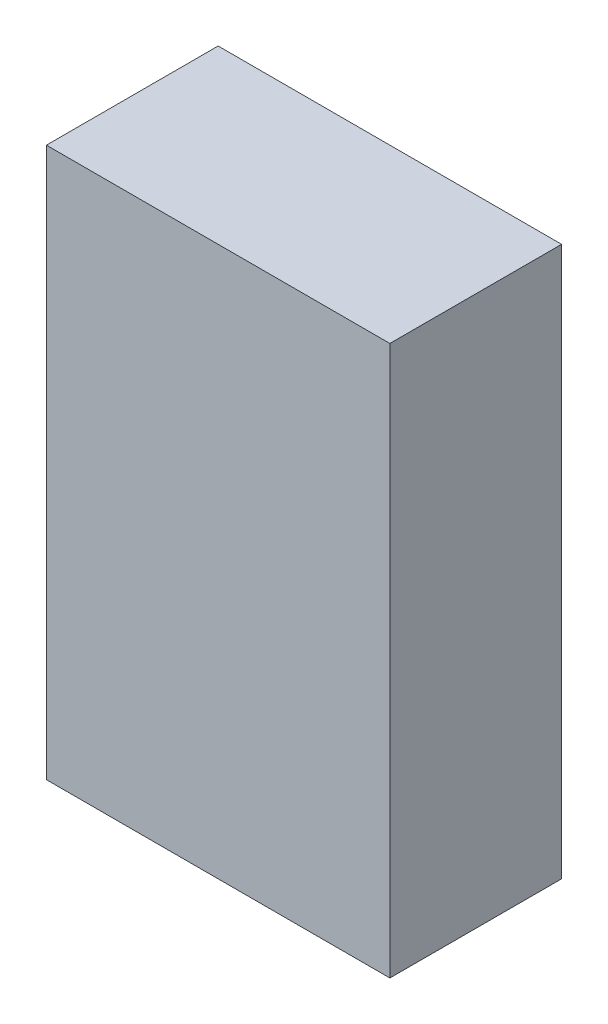
ISO-10303-21;
HEADER;
FILE_DESCRIPTION(('STEP AP214'),'2;1');
FILE_NAME('part.step','',(''),(''),'','','');
FILE_SCHEMA(('AUTOMOTIVE_DESIGN { 1 0 10303 214 1 1 1 1 }'));
ENDSEC;
DATA;
#1=APPLICATION_CONTEXT('core data for automotive mechanical design processes');
#2=APPLICATION_PROTOCOL_DEFINITION('international standard','automotive_design',2000,#1);
#3=PRODUCT_CONTEXT('',#1,'mechanical');
#4=PRODUCT('Part','Part','',(#3));
#5=PRODUCT_RELATED_PRODUCT_CATEGORY('part','',(#4));
#6=PRODUCT_DEFINITION_FORMATION('','',#4);
#7=PRODUCT_DEFINITION_CONTEXT('part definition',#1,'design');
#8=PRODUCT_DEFINITION('design','',#6,#7);
#9=PRODUCT_DEFINITION_SHAPE('','',#8);
#10=(LENGTH_UNIT() NAMED_UNIT(*) SI_UNIT(.MILLI.,.METRE.));
#11=(NAMED_UNIT(*) PLANE_ANGLE_UNIT() SI_UNIT($,.RADIAN.));
#12=(NAMED_UNIT(*) SI_UNIT($,.STERADIAN.) SOLID_ANGLE_UNIT());
#13=UNCERTAINTY_MEASURE_WITH_UNIT(LENGTH_MEASURE(1.E-05),#10,'distance_accuracy_value','');
#14=(GEOMETRIC_REPRESENTATION_CONTEXT(3) GLOBAL_UNCERTAINTY_ASSIGNED_CONTEXT((#13)) GLOBAL_UNIT_ASSIGNED_CONTEXT((#10,
#11,#12)) REPRESENTATION_CONTEXT('',''));
#15=CARTESIAN_POINT('',(0.,0.,0.));
#16=DIRECTION('',(0.,0.,1.));
#17=DIRECTION('',(1.,0.,0.));
#18=AXIS2_PLACEMENT_3D('',#15,#16,#17);
#19=CARTESIAN_POINT('',(-0.635,1.016,0.635));
#20=DIRECTION('',(0.,0.,-1.));
#21=DIRECTION('',(-1.,0.,0.));
#22=AXIS2_PLACEMENT_3D('',#19,#20,#21);
#23=PLANE('',#22);
#24=DIRECTION('',(1.,0.,0.));
#25=VECTOR('',#24,1.);
#26=CARTESIAN_POINT('',(-0.635,-1.016,0.635));
#27=LINE('',#26,#25);
#28=CARTESIAN_POINT('',(-0.635,-1.016,0.635));
#29=VERTEX_POINT('',#28);
#30=CARTESIAN_POINT('',(0.635,-1.016,0.635));
#31=VERTEX_POINT('',#30);
#32=EDGE_CURVE('E55',#29,#31,#27,.T.);
#33=ORIENTED_EDGE('',*,*,#32,.T.);
#34=DIRECTION('',(0.,1.,0.));
#35=VECTOR('',#34,1.);
#36=CARTESIAN_POINT('',(0.635,-1.016,0.635));
#37=LINE('',#36,#35);
#38=CARTESIAN_POINT('',(0.635,1.016,0.635));
#39=VERTEX_POINT('',#38);
#40=EDGE_CURVE('E57',#31,#39,#37,.T.);
#41=ORIENTED_EDGE('',*,*,#40,.T.);
#42=DIRECTION('',(1.,0.,0.));
#43=VECTOR('',#42,1.);
#44=CARTESIAN_POINT('',(0.635,1.016,0.635));
#45=LINE('',#44,#43);
#46=CARTESIAN_POINT('',(-0.635,1.016,0.635));
#47=VERTEX_POINT('',#46);
#48=EDGE_CURVE('E20',#39,#47,#45,.F.);
#49=ORIENTED_EDGE('',*,*,#48,.T.);
#50=DIRECTION('',(0.,1.,0.));
#51=VECTOR('',#50,1.);
#52=CARTESIAN_POINT('',(-0.635,1.016,0.635));
#53=LINE('',#52,#51);
#54=EDGE_CURVE('E80',#47,#29,#53,.F.);
#55=ORIENTED_EDGE('',*,*,#54,.T.);
#56=EDGE_LOOP('',(#33,#41,#49,#55));
#57=FACE_BOUND('',#56,.T.);
#58=ADVANCED_FACE('F17',(#57),#23,.F.);
#59=CARTESIAN_POINT('',(0.635,1.016,0.));
#60=DIRECTION('',(0.,-1.,0.));
#61=DIRECTION('',(0.,0.,-1.));
#62=AXIS2_PLACEMENT_3D('',#59,#60,#61);
#63=PLANE('',#62);
#64=DIRECTION('',(0.,0.,-1.));
#65=VECTOR('',#64,1.);
#66=CARTESIAN_POINT('',(-0.635,1.016,0.));
#67=LINE('',#66,#65);
#68=CARTESIAN_POINT('',(-0.635,1.016,0.));
#69=VERTEX_POINT('',#68);
#70=EDGE_CURVE('E68',#69,#47,#67,.F.);
#71=ORIENTED_EDGE('',*,*,#70,.T.);
#72=ORIENTED_EDGE('',*,*,#48,.F.);
#73=DIRECTION('',(0.,0.,1.));
#74=VECTOR('',#73,1.);
#75=CARTESIAN_POINT('',(0.635,1.016,0.));
#76=LINE('',#75,#74);
#77=CARTESIAN_POINT('',(0.635,1.016,0.));
#78=VERTEX_POINT('',#77);
#79=EDGE_CURVE('E63',#39,#78,#76,.F.);
#80=ORIENTED_EDGE('',*,*,#79,.T.);
#81=DIRECTION('',(-1.,0.,0.));
#82=VECTOR('',#81,1.);
#83=CARTESIAN_POINT('',(-0.635,1.016,0.));
#84=LINE('',#83,#82);
#85=EDGE_CURVE('E83',#69,#78,#84,.F.);
#86=ORIENTED_EDGE('',*,*,#85,.F.);
#87=EDGE_LOOP('',(#71,#72,#80,#86));
#88=FACE_BOUND('',#87,.T.);
#89=ADVANCED_FACE('F65',(#88),#63,.F.);
#90=CARTESIAN_POINT('',(0.635,-1.016,0.));
#91=DIRECTION('',(-1.,0.,0.));
#92=DIRECTION('',(0.,0.,1.));
#93=AXIS2_PLACEMENT_3D('',#90,#91,#92);
#94=PLANE('',#93);
#95=ORIENTED_EDGE('',*,*,#79,.F.);
#96=ORIENTED_EDGE('',*,*,#40,.F.);
#97=DIRECTION('',(0.,0.,1.));
#98=VECTOR('',#97,1.);
#99=CARTESIAN_POINT('',(0.635,-1.016,0.));
#100=LINE('',#99,#98);
#101=CARTESIAN_POINT('',(0.635,-1.016,0.));
#102=VERTEX_POINT('',#101);
#103=EDGE_CURVE('E75',#31,#102,#100,.F.);
#104=ORIENTED_EDGE('',*,*,#103,.T.);
#105=DIRECTION('',(0.,1.,0.));
#106=VECTOR('',#105,1.);
#107=CARTESIAN_POINT('',(0.635,1.016,0.));
#108=LINE('',#107,#106);
#109=EDGE_CURVE('E72',#78,#102,#108,.F.);
#110=ORIENTED_EDGE('',*,*,#109,.F.);
#111=EDGE_LOOP('',(#95,#96,#104,#110));
#112=FACE_BOUND('',#111,.T.);
#113=ADVANCED_FACE('F70',(#112),#94,.F.);
#114=CARTESIAN_POINT('',(-0.635,-1.016,0.));
#115=DIRECTION('',(0.,1.,0.));
#116=DIRECTION('',(0.,0.,1.));
#117=AXIS2_PLACEMENT_3D('',#114,#115,#116);
#118=PLANE('',#117);
#119=ORIENTED_EDGE('',*,*,#103,.F.);
#120=ORIENTED_EDGE('',*,*,#32,.F.);
#121=DIRECTION('',(0.,0.,-1.));
#122=VECTOR('',#121,1.);
#123=CARTESIAN_POINT('',(-0.635,-1.016,0.));
#124=LINE('',#123,#122);
#125=CARTESIAN_POINT('',(-0.635,-1.016,0.));
#126=VERTEX_POINT('',#125);
#127=EDGE_CURVE('E35',#29,#126,#124,.T.);
#128=ORIENTED_EDGE('',*,*,#127,.T.);
#129=DIRECTION('',(-1.,0.,0.));
#130=VECTOR('',#129,1.);
#131=CARTESIAN_POINT('',(-0.635,-1.016,0.));
#132=LINE('',#131,#130);
#133=EDGE_CURVE('E26',#102,#126,#132,.T.);
#134=ORIENTED_EDGE('',*,*,#133,.F.);
#135=EDGE_LOOP('',(#119,#120,#128,#134));
#136=FACE_BOUND('',#135,.T.);
#137=ADVANCED_FACE('F89',(#136),#118,.F.);
#138=CARTESIAN_POINT('',(-0.635,1.016,0.));
#139=DIRECTION('',(1.,0.,0.));
#140=DIRECTION('',(0.,0.,-1.));
#141=AXIS2_PLACEMENT_3D('',#138,#139,#140);
#142=PLANE('',#141);
#143=ORIENTED_EDGE('',*,*,#127,.F.);
#144=ORIENTED_EDGE('',*,*,#54,.F.);
#145=ORIENTED_EDGE('',*,*,#70,.F.);
#146=DIRECTION('',(0.,1.,0.));
#147=VECTOR('',#146,1.);
#148=CARTESIAN_POINT('',(-0.635,1.016,0.));
#149=LINE('',#148,#147);
#150=EDGE_CURVE('E11',#126,#69,#149,.T.);
#151=ORIENTED_EDGE('',*,*,#150,.F.);
#152=EDGE_LOOP('',(#143,#144,#145,#151));
#153=FACE_BOUND('',#152,.T.);
#154=ADVANCED_FACE('F91',(#153),#142,.F.);
#155=CARTESIAN_POINT('',(-0.635,1.016,0.));
#156=DIRECTION('',(0.,0.,-1.));
#157=DIRECTION('',(-1.,0.,0.));
#158=AXIS2_PLACEMENT_3D('',#155,#156,#157);
#159=PLANE('',#158);
#160=ORIENTED_EDGE('',*,*,#133,.T.);
#161=ORIENTED_EDGE('',*,*,#150,.T.);
#162=ORIENTED_EDGE('',*,*,#85,.T.);
#163=ORIENTED_EDGE('',*,*,#109,.T.);
#164=EDGE_LOOP('',(#160,#161,#162,#163));
#165=FACE_BOUND('',#164,.T.);
#166=ADVANCED_FACE('F88',(#165),#159,.T.);
#167=CLOSED_SHELL('',(#58,#89,#113,#137,#154,#166));
#168=MANIFOLD_SOLID_BREP('B1',#167);
#169=ADVANCED_BREP_SHAPE_REPRESENTATION('',(#18,#168),#14);
#170=SHAPE_DEFINITION_REPRESENTATION(#9,#169);
ENDSEC;
END-ISO-10303-21;
